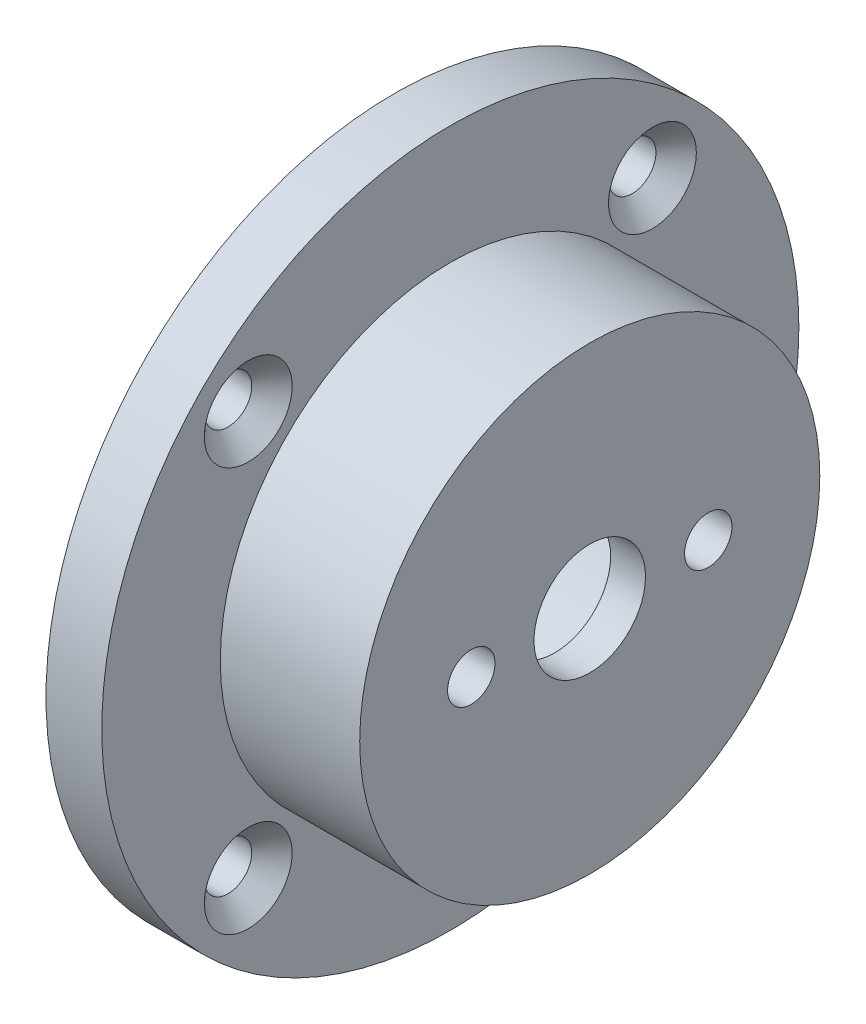
ISO-10303-21;
HEADER;
FILE_DESCRIPTION(('STEP AP214'),'2;1');
FILE_NAME('part.step','',(''),(''),'','','');
FILE_SCHEMA(('AUTOMOTIVE_DESIGN { 1 0 10303 214 1 1 1 1 }'));
ENDSEC;
DATA;
#1=APPLICATION_CONTEXT('core data for automotive mechanical design processes');
#2=APPLICATION_PROTOCOL_DEFINITION('international standard','automotive_design',2000,#1);
#3=PRODUCT_CONTEXT('',#1,'mechanical');
#4=PRODUCT('Part','Part','',(#3));
#5=PRODUCT_RELATED_PRODUCT_CATEGORY('part','',(#4));
#6=PRODUCT_DEFINITION_FORMATION('','',#4);
#7=PRODUCT_DEFINITION_CONTEXT('part definition',#1,'design');
#8=PRODUCT_DEFINITION('design','',#6,#7);
#9=PRODUCT_DEFINITION_SHAPE('','',#8);
#10=(LENGTH_UNIT() NAMED_UNIT(*) SI_UNIT(.MILLI.,.METRE.));
#11=(NAMED_UNIT(*) PLANE_ANGLE_UNIT() SI_UNIT($,.RADIAN.));
#12=(NAMED_UNIT(*) SI_UNIT($,.STERADIAN.) SOLID_ANGLE_UNIT());
#13=UNCERTAINTY_MEASURE_WITH_UNIT(LENGTH_MEASURE(1.E-05),#10,'distance_accuracy_value','');
#14=(GEOMETRIC_REPRESENTATION_CONTEXT(3) GLOBAL_UNCERTAINTY_ASSIGNED_CONTEXT((#13)) GLOBAL_UNIT_ASSIGNED_CONTEXT((#10,
#11,#12)) REPRESENTATION_CONTEXT('',''));
#15=CARTESIAN_POINT('',(0.,0.,0.));
#16=DIRECTION('',(0.,0.,1.));
#17=DIRECTION('',(1.,0.,0.));
#18=AXIS2_PLACEMENT_3D('',#15,#16,#17);
#19=CARTESIAN_POINT('',(4.,0.,0.));
#20=DIRECTION('',(1.,0.,0.));
#21=DIRECTION('',(0.,0.,-1.));
#22=AXIS2_PLACEMENT_3D('',#19,#20,#21);
#23=PLANE('',#22);
#24=CARTESIAN_POINT('',(4.,14.4956890143241,14.4956890143244));
#25=DIRECTION('',(1.,0.,0.));
#26=DIRECTION('',(0.,0.,-1.));
#27=AXIS2_PLACEMENT_3D('',#24,#25,#26);
#28=CIRCLE('',#27,3.15);
#29=CARTESIAN_POINT('',(4.,14.4956890143241,11.3456890143244));
#30=VERTEX_POINT('',#29);
#31=EDGE_CURVE('E147',#30,#30,#28,.T.);
#32=ORIENTED_EDGE('',*,*,#31,.F.);
#33=EDGE_LOOP('',(#32));
#34=FACE_BOUND('',#33,.T.);
#35=CARTESIAN_POINT('',(4.,14.4956890143242,-14.4956890143242));
#36=DIRECTION('',(1.,0.,0.));
#37=DIRECTION('',(0.,0.,-1.));
#38=AXIS2_PLACEMENT_3D('',#35,#36,#37);
#39=CIRCLE('',#38,3.15);
#40=CARTESIAN_POINT('',(4.,14.4956890143242,-17.6456890143242));
#41=VERTEX_POINT('',#40);
#42=EDGE_CURVE('E140',#41,#41,#39,.T.);
#43=ORIENTED_EDGE('',*,*,#42,.F.);
#44=EDGE_LOOP('',(#43));
#45=FACE_BOUND('',#44,.T.);
#46=CARTESIAN_POINT('',(4.,-14.4956890143242,-14.4956890143243));
#47=DIRECTION('',(1.,0.,0.));
#48=DIRECTION('',(0.,0.,-1.));
#49=AXIS2_PLACEMENT_3D('',#46,#47,#48);
#50=CIRCLE('',#49,3.15);
#51=CARTESIAN_POINT('',(4.,-14.4956890143242,-17.6456890143243));
#52=VERTEX_POINT('',#51);
#53=EDGE_CURVE('E133',#52,#52,#50,.T.);
#54=ORIENTED_EDGE('',*,*,#53,.F.);
#55=EDGE_LOOP('',(#54));
#56=FACE_BOUND('',#55,.T.);
#57=CARTESIAN_POINT('',(4.,-14.4956890143242,14.4956890143242));
#58=DIRECTION('',(1.,0.,0.));
#59=DIRECTION('',(0.,0.,-1.));
#60=AXIS2_PLACEMENT_3D('',#57,#58,#59);
#61=CIRCLE('',#60,3.15);
#62=CARTESIAN_POINT('',(4.,-14.4956890143242,11.3456890143242));
#63=VERTEX_POINT('',#62);
#64=EDGE_CURVE('E124',#63,#63,#61,.T.);
#65=ORIENTED_EDGE('',*,*,#64,.F.);
#66=EDGE_LOOP('',(#65));
#67=FACE_BOUND('',#66,.T.);
#68=CARTESIAN_POINT('',(4.,0.,0.));
#69=DIRECTION('',(1.,0.,0.));
#70=DIRECTION('',(0.,0.,-1.));
#71=AXIS2_PLACEMENT_3D('',#68,#69,#70);
#72=CIRCLE('',#71,25.);
#73=CARTESIAN_POINT('',(4.,0.,-25.));
#74=VERTEX_POINT('',#73);
#75=EDGE_CURVE('E11',#74,#74,#72,.T.);
#76=ORIENTED_EDGE('',*,*,#75,.T.);
#77=EDGE_LOOP('',(#76));
#78=FACE_BOUND('',#77,.T.);
#79=CARTESIAN_POINT('',(4.,0.,0.));
#80=DIRECTION('',(1.,0.,0.));
#81=DIRECTION('',(0.,0.,-1.));
#82=AXIS2_PLACEMENT_3D('',#79,#80,#81);
#83=CIRCLE('',#82,16.5);
#84=CARTESIAN_POINT('',(4.,0.,-16.5));
#85=VERTEX_POINT('',#84);
#86=EDGE_CURVE('E50',#85,#85,#83,.T.);
#87=ORIENTED_EDGE('',*,*,#86,.F.);
#88=EDGE_LOOP('',(#87));
#89=FACE_BOUND('',#88,.T.);
#90=ADVANCED_FACE('F34',(#34,#45,#56,#67,#78,#89),#23,.T.);
#91=CARTESIAN_POINT('',(4.,0.,0.));
#92=DIRECTION('',(-1.,0.,0.));
#93=DIRECTION('',(0.,0.,1.));
#94=AXIS2_PLACEMENT_3D('',#91,#92,#93);
#95=CYLINDRICAL_SURFACE('',#94,25.);
#96=ORIENTED_EDGE('',*,*,#75,.F.);
#97=EDGE_LOOP('',(#96));
#98=FACE_BOUND('',#97,.T.);
#99=CARTESIAN_POINT('',(0.,0.,0.));
#100=DIRECTION('',(1.,0.,0.));
#101=DIRECTION('',(0.,0.,-1.));
#102=AXIS2_PLACEMENT_3D('',#99,#100,#101);
#103=CIRCLE('',#102,25.);
#104=CARTESIAN_POINT('',(0.,0.,-25.));
#105=VERTEX_POINT('',#104);
#106=EDGE_CURVE('E42',#105,#105,#103,.T.);
#107=ORIENTED_EDGE('',*,*,#106,.T.);
#108=EDGE_LOOP('',(#107));
#109=FACE_BOUND('',#108,.T.);
#110=ADVANCED_FACE('F36',(#98,#109),#95,.T.);
#111=CARTESIAN_POINT('',(0.,0.,0.));
#112=DIRECTION('',(1.,0.,0.));
#113=DIRECTION('',(0.,0.,-1.));
#114=AXIS2_PLACEMENT_3D('',#111,#112,#113);
#115=PLANE('',#114);
#116=CARTESIAN_POINT('',(0.,0.,0.));
#117=DIRECTION('',(-1.,0.,0.));
#118=DIRECTION('',(0.,0.,1.));
#119=AXIS2_PLACEMENT_3D('',#116,#117,#118);
#120=CIRCLE('',#119,13.125);
#121=CARTESIAN_POINT('',(0.,0.,13.125));
#122=VERTEX_POINT('',#121);
#123=EDGE_CURVE('E101',#122,#122,#120,.T.);
#124=ORIENTED_EDGE('',*,*,#123,.F.);
#125=EDGE_LOOP('',(#124));
#126=FACE_BOUND('',#125,.T.);
#127=CARTESIAN_POINT('',(0.,14.4956890143241,14.4956890143244));
#128=DIRECTION('',(1.,0.,0.));
#129=DIRECTION('',(0.,0.,-1.));
#130=AXIS2_PLACEMENT_3D('',#127,#128,#129);
#131=CIRCLE('',#130,1.7);
#132=CARTESIAN_POINT('',(0.,14.4956890143241,12.7956890143244));
#133=VERTEX_POINT('',#132);
#134=EDGE_CURVE('E105',#133,#133,#131,.T.);
#135=ORIENTED_EDGE('',*,*,#134,.T.);
#136=EDGE_LOOP('',(#135));
#137=FACE_BOUND('',#136,.T.);
#138=CARTESIAN_POINT('',(0.,14.4956890143242,-14.4956890143242));
#139=DIRECTION('',(1.,0.,0.));
#140=DIRECTION('',(0.,0.,-1.));
#141=AXIS2_PLACEMENT_3D('',#138,#139,#140);
#142=CIRCLE('',#141,1.7);
#143=CARTESIAN_POINT('',(0.,14.4956890143242,-16.1956890143242));
#144=VERTEX_POINT('',#143);
#145=EDGE_CURVE('E109',#144,#144,#142,.T.);
#146=ORIENTED_EDGE('',*,*,#145,.T.);
#147=EDGE_LOOP('',(#146));
#148=FACE_BOUND('',#147,.T.);
#149=CARTESIAN_POINT('',(0.,-14.4956890143242,-14.4956890143243));
#150=DIRECTION('',(1.,0.,0.));
#151=DIRECTION('',(0.,0.,-1.));
#152=AXIS2_PLACEMENT_3D('',#149,#150,#151);
#153=CIRCLE('',#152,1.7);
#154=CARTESIAN_POINT('',(0.,-14.4956890143242,-16.1956890143243));
#155=VERTEX_POINT('',#154);
#156=EDGE_CURVE('E113',#155,#155,#153,.T.);
#157=ORIENTED_EDGE('',*,*,#156,.T.);
#158=EDGE_LOOP('',(#157));
#159=FACE_BOUND('',#158,.T.);
#160=CARTESIAN_POINT('',(0.,-14.4956890143242,14.4956890143242));
#161=DIRECTION('',(1.,0.,0.));
#162=DIRECTION('',(0.,0.,-1.));
#163=AXIS2_PLACEMENT_3D('',#160,#161,#162);
#164=CIRCLE('',#163,1.7);
#165=CARTESIAN_POINT('',(0.,-14.4956890143242,12.7956890143242));
#166=VERTEX_POINT('',#165);
#167=EDGE_CURVE('E117',#166,#166,#164,.T.);
#168=ORIENTED_EDGE('',*,*,#167,.T.);
#169=EDGE_LOOP('',(#168));
#170=FACE_BOUND('',#169,.T.);
#171=ORIENTED_EDGE('',*,*,#106,.F.);
#172=EDGE_LOOP('',(#171));
#173=FACE_BOUND('',#172,.T.);
#174=ADVANCED_FACE('F85',(#126,#137,#148,#159,#170,#173),#115,.F.);
#175=CARTESIAN_POINT('',(14.,0.,0.));
#176=DIRECTION('',(-1.,0.,0.));
#177=DIRECTION('',(0.,0.,1.));
#178=AXIS2_PLACEMENT_3D('',#175,#176,#177);
#179=CYLINDRICAL_SURFACE('',#178,16.5);
#180=CARTESIAN_POINT('',(14.,0.,0.));
#181=DIRECTION('',(1.,0.,0.));
#182=DIRECTION('',(0.,0.,-1.));
#183=AXIS2_PLACEMENT_3D('',#180,#181,#182);
#184=CIRCLE('',#183,16.5);
#185=CARTESIAN_POINT('',(14.,0.,-16.5));
#186=VERTEX_POINT('',#185);
#187=EDGE_CURVE('E47',#186,#186,#184,.T.);
#188=ORIENTED_EDGE('',*,*,#187,.F.);
#189=EDGE_LOOP('',(#188));
#190=FACE_BOUND('',#189,.T.);
#191=ORIENTED_EDGE('',*,*,#86,.T.);
#192=EDGE_LOOP('',(#191));
#193=FACE_BOUND('',#192,.T.);
#194=ADVANCED_FACE('F77',(#190,#193),#179,.T.);
#195=CARTESIAN_POINT('',(14.,0.,0.));
#196=DIRECTION('',(1.,0.,0.));
#197=DIRECTION('',(0.,0.,-1.));
#198=AXIS2_PLACEMENT_3D('',#195,#196,#197);
#199=PLANE('',#198);
#200=CARTESIAN_POINT('',(14.,0.,-8.5));
#201=DIRECTION('',(1.,0.,0.));
#202=DIRECTION('',(0.,0.,-1.));
#203=AXIS2_PLACEMENT_3D('',#200,#201,#202);
#204=CIRCLE('',#203,1.69999999999999);
#205=CARTESIAN_POINT('',(14.,0.,-10.2));
#206=VERTEX_POINT('',#205);
#207=EDGE_CURVE('E68',#206,#206,#204,.T.);
#208=ORIENTED_EDGE('',*,*,#207,.F.);
#209=EDGE_LOOP('',(#208));
#210=FACE_BOUND('',#209,.T.);
#211=CARTESIAN_POINT('',(14.,0.,8.5));
#212=DIRECTION('',(1.,0.,0.));
#213=DIRECTION('',(0.,0.,-1.));
#214=AXIS2_PLACEMENT_3D('',#211,#212,#213);
#215=CIRCLE('',#214,1.69999999999999);
#216=CARTESIAN_POINT('',(14.,0.,6.80000000000001));
#217=VERTEX_POINT('',#216);
#218=EDGE_CURVE('E58',#217,#217,#215,.T.);
#219=ORIENTED_EDGE('',*,*,#218,.F.);
#220=EDGE_LOOP('',(#219));
#221=FACE_BOUND('',#220,.T.);
#222=CARTESIAN_POINT('',(14.,0.,0.));
#223=DIRECTION('',(1.,0.,0.));
#224=DIRECTION('',(0.,0.,-1.));
#225=AXIS2_PLACEMENT_3D('',#222,#223,#224);
#226=CIRCLE('',#225,4.);
#227=CARTESIAN_POINT('',(14.,0.,-4.));
#228=VERTEX_POINT('',#227);
#229=EDGE_CURVE('E55',#228,#228,#226,.T.);
#230=ORIENTED_EDGE('',*,*,#229,.F.);
#231=EDGE_LOOP('',(#230));
#232=FACE_BOUND('',#231,.T.);
#233=ORIENTED_EDGE('',*,*,#187,.T.);
#234=EDGE_LOOP('',(#233));
#235=FACE_BOUND('',#234,.T.);
#236=ADVANCED_FACE('F96',(#210,#221,#232,#235),#199,.T.);
#237=CARTESIAN_POINT('',(11.5,0.,0.));
#238=DIRECTION('',(1.,0.,0.));
#239=DIRECTION('',(0.,0.,-1.));
#240=AXIS2_PLACEMENT_3D('',#237,#238,#239);
#241=PLANE('',#240);
#242=CARTESIAN_POINT('',(11.5,0.,-8.5));
#243=DIRECTION('',(1.,0.,0.));
#244=DIRECTION('',(0.,0.,-1.));
#245=AXIS2_PLACEMENT_3D('',#242,#243,#244);
#246=CIRCLE('',#245,1.69999999999999);
#247=CARTESIAN_POINT('',(11.5,0.,-10.2));
#248=VERTEX_POINT('',#247);
#249=EDGE_CURVE('E38',#248,#248,#246,.T.);
#250=ORIENTED_EDGE('',*,*,#249,.T.);
#251=EDGE_LOOP('',(#250));
#252=FACE_BOUND('',#251,.T.);
#253=CARTESIAN_POINT('',(11.5,0.,8.5));
#254=DIRECTION('',(1.,0.,0.));
#255=DIRECTION('',(0.,0.,-1.));
#256=AXIS2_PLACEMENT_3D('',#253,#254,#255);
#257=CIRCLE('',#256,1.69999999999999);
#258=CARTESIAN_POINT('',(11.5,0.,6.80000000000001));
#259=VERTEX_POINT('',#258);
#260=EDGE_CURVE('E56',#259,#259,#257,.T.);
#261=ORIENTED_EDGE('',*,*,#260,.T.);
#262=EDGE_LOOP('',(#261));
#263=FACE_BOUND('',#262,.T.);
#264=CARTESIAN_POINT('',(11.5,0.,0.));
#265=DIRECTION('',(1.,0.,0.));
#266=DIRECTION('',(0.,0.,-1.));
#267=AXIS2_PLACEMENT_3D('',#264,#265,#266);
#268=CIRCLE('',#267,4.);
#269=CARTESIAN_POINT('',(11.5,0.,-4.));
#270=VERTEX_POINT('',#269);
#271=EDGE_CURVE('E53',#270,#270,#268,.T.);
#272=ORIENTED_EDGE('',*,*,#271,.T.);
#273=EDGE_LOOP('',(#272));
#274=FACE_BOUND('',#273,.T.);
#275=CARTESIAN_POINT('',(11.5,0.,0.));
#276=DIRECTION('',(1.,0.,0.));
#277=DIRECTION('',(0.,0.,-1.));
#278=AXIS2_PLACEMENT_3D('',#275,#276,#277);
#279=CIRCLE('',#278,13.125);
#280=CARTESIAN_POINT('',(11.5,0.,-13.125));
#281=VERTEX_POINT('',#280);
#282=EDGE_CURVE('E150',#281,#281,#279,.F.);
#283=ORIENTED_EDGE('',*,*,#282,.T.);
#284=EDGE_LOOP('',(#283));
#285=FACE_BOUND('',#284,.T.);
#286=ADVANCED_FACE('F161',(#252,#263,#274,#285),#241,.F.);
#287=CARTESIAN_POINT('',(10.,0.,0.));
#288=DIRECTION('',(1.,0.,0.));
#289=DIRECTION('',(0.,0.,-1.));
#290=AXIS2_PLACEMENT_3D('',#287,#288,#289);
#291=CYLINDRICAL_SURFACE('',#290,4.);
#292=ORIENTED_EDGE('',*,*,#229,.T.);
#293=EDGE_LOOP('',(#292));
#294=FACE_BOUND('',#293,.T.);
#295=ORIENTED_EDGE('',*,*,#271,.F.);
#296=EDGE_LOOP('',(#295));
#297=FACE_BOUND('',#296,.T.);
#298=ADVANCED_FACE('F163',(#294,#297),#291,.F.);
#299=CARTESIAN_POINT('',(14.,0.,8.5));
#300=DIRECTION('',(1.,0.,0.));
#301=DIRECTION('',(0.,0.,-1.));
#302=AXIS2_PLACEMENT_3D('',#299,#300,#301);
#303=CYLINDRICAL_SURFACE('',#302,1.69999999999999);
#304=ORIENTED_EDGE('',*,*,#218,.T.);
#305=EDGE_LOOP('',(#304));
#306=FACE_BOUND('',#305,.T.);
#307=ORIENTED_EDGE('',*,*,#260,.F.);
#308=EDGE_LOOP('',(#307));
#309=FACE_BOUND('',#308,.T.);
#310=ADVANCED_FACE('F170',(#306,#309),#303,.F.);
#311=CARTESIAN_POINT('',(14.,0.,-8.5));
#312=DIRECTION('',(1.,0.,0.));
#313=DIRECTION('',(0.,0.,-1.));
#314=AXIS2_PLACEMENT_3D('',#311,#312,#313);
#315=CYLINDRICAL_SURFACE('',#314,1.69999999999999);
#316=ORIENTED_EDGE('',*,*,#207,.T.);
#317=EDGE_LOOP('',(#316));
#318=FACE_BOUND('',#317,.T.);
#319=ORIENTED_EDGE('',*,*,#249,.F.);
#320=EDGE_LOOP('',(#319));
#321=FACE_BOUND('',#320,.T.);
#322=ADVANCED_FACE('F177',(#318,#321),#315,.F.);
#323=CARTESIAN_POINT('',(4.,-14.4956890143242,14.4956890143242));
#324=DIRECTION('',(1.,0.,0.));
#325=DIRECTION('',(0.,0.,-1.));
#326=AXIS2_PLACEMENT_3D('',#323,#324,#325);
#327=CYLINDRICAL_SURFACE('',#326,1.7);
#328=ORIENTED_EDGE('',*,*,#167,.F.);
#329=EDGE_LOOP('',(#328));
#330=FACE_BOUND('',#329,.T.);
#331=CARTESIAN_POINT('',(2.55,-14.4956890143242,14.4956890143242));
#332=DIRECTION('',(1.,0.,0.));
#333=DIRECTION('',(0.,0.,-1.));
#334=AXIS2_PLACEMENT_3D('',#331,#332,#333);
#335=CIRCLE('',#334,1.7);
#336=CARTESIAN_POINT('',(2.55,-14.4956890143242,12.7956890143242));
#337=VERTEX_POINT('',#336);
#338=EDGE_CURVE('E121',#337,#337,#335,.T.);
#339=ORIENTED_EDGE('',*,*,#338,.T.);
#340=EDGE_LOOP('',(#339));
#341=FACE_BOUND('',#340,.T.);
#342=ADVANCED_FACE('F180',(#330,#341),#327,.F.);
#343=CARTESIAN_POINT('',(4.,-14.4956890143242,14.4956890143242));
#344=DIRECTION('',(1.,0.,0.));
#345=DIRECTION('',(0.,0.,-1.));
#346=AXIS2_PLACEMENT_3D('',#343,#344,#345);
#347=CONICAL_SURFACE('',#346,3.15,0.785398163397449);
#348=ORIENTED_EDGE('',*,*,#338,.F.);
#349=EDGE_LOOP('',(#348));
#350=FACE_BOUND('',#349,.T.);
#351=ORIENTED_EDGE('',*,*,#64,.T.);
#352=EDGE_LOOP('',(#351));
#353=FACE_BOUND('',#352,.T.);
#354=ADVANCED_FACE('F184',(#350,#353),#347,.F.);
#355=CARTESIAN_POINT('',(4.,-14.4956890143242,-14.4956890143243));
#356=DIRECTION('',(1.,0.,0.));
#357=DIRECTION('',(0.,0.,-1.));
#358=AXIS2_PLACEMENT_3D('',#355,#356,#357);
#359=CYLINDRICAL_SURFACE('',#358,1.7);
#360=ORIENTED_EDGE('',*,*,#156,.F.);
#361=EDGE_LOOP('',(#360));
#362=FACE_BOUND('',#361,.T.);
#363=CARTESIAN_POINT('',(2.55,-14.4956890143242,-14.4956890143243));
#364=DIRECTION('',(1.,0.,0.));
#365=DIRECTION('',(0.,0.,-1.));
#366=AXIS2_PLACEMENT_3D('',#363,#364,#365);
#367=CIRCLE('',#366,1.7);
#368=CARTESIAN_POINT('',(2.55,-14.4956890143242,-16.1956890143243));
#369=VERTEX_POINT('',#368);
#370=EDGE_CURVE('E130',#369,#369,#367,.T.);
#371=ORIENTED_EDGE('',*,*,#370,.T.);
#372=EDGE_LOOP('',(#371));
#373=FACE_BOUND('',#372,.T.);
#374=ADVANCED_FACE('F187',(#362,#373),#359,.F.);
#375=CARTESIAN_POINT('',(4.,-14.4956890143242,-14.4956890143243));
#376=DIRECTION('',(1.,0.,0.));
#377=DIRECTION('',(0.,0.,-1.));
#378=AXIS2_PLACEMENT_3D('',#375,#376,#377);
#379=CONICAL_SURFACE('',#378,3.15,0.785398163397448);
#380=ORIENTED_EDGE('',*,*,#370,.F.);
#381=EDGE_LOOP('',(#380));
#382=FACE_BOUND('',#381,.T.);
#383=ORIENTED_EDGE('',*,*,#53,.T.);
#384=EDGE_LOOP('',(#383));
#385=FACE_BOUND('',#384,.T.);
#386=ADVANCED_FACE('F191',(#382,#385),#379,.F.);
#387=CARTESIAN_POINT('',(4.,14.4956890143242,-14.4956890143242));
#388=DIRECTION('',(1.,0.,0.));
#389=DIRECTION('',(0.,0.,-1.));
#390=AXIS2_PLACEMENT_3D('',#387,#388,#389);
#391=CYLINDRICAL_SURFACE('',#390,1.7);
#392=ORIENTED_EDGE('',*,*,#145,.F.);
#393=EDGE_LOOP('',(#392));
#394=FACE_BOUND('',#393,.T.);
#395=CARTESIAN_POINT('',(2.55,14.4956890143242,-14.4956890143242));
#396=DIRECTION('',(1.,0.,0.));
#397=DIRECTION('',(0.,0.,-1.));
#398=AXIS2_PLACEMENT_3D('',#395,#396,#397);
#399=CIRCLE('',#398,1.7);
#400=CARTESIAN_POINT('',(2.55,14.4956890143242,-16.1956890143242));
#401=VERTEX_POINT('',#400);
#402=EDGE_CURVE('E137',#401,#401,#399,.T.);
#403=ORIENTED_EDGE('',*,*,#402,.T.);
#404=EDGE_LOOP('',(#403));
#405=FACE_BOUND('',#404,.T.);
#406=ADVANCED_FACE('F195',(#394,#405),#391,.F.);
#407=CARTESIAN_POINT('',(4.,14.4956890143242,-14.4956890143242));
#408=DIRECTION('',(1.,0.,0.));
#409=DIRECTION('',(0.,0.,-1.));
#410=AXIS2_PLACEMENT_3D('',#407,#408,#409);
#411=CONICAL_SURFACE('',#410,3.15,0.785398163397448);
#412=ORIENTED_EDGE('',*,*,#402,.F.);
#413=EDGE_LOOP('',(#412));
#414=FACE_BOUND('',#413,.T.);
#415=ORIENTED_EDGE('',*,*,#42,.T.);
#416=EDGE_LOOP('',(#415));
#417=FACE_BOUND('',#416,.T.);
#418=ADVANCED_FACE('F199',(#414,#417),#411,.F.);
#419=CARTESIAN_POINT('',(4.,14.4956890143241,14.4956890143244));
#420=DIRECTION('',(1.,0.,0.));
#421=DIRECTION('',(0.,0.,-1.));
#422=AXIS2_PLACEMENT_3D('',#419,#420,#421);
#423=CYLINDRICAL_SURFACE('',#422,1.7);
#424=ORIENTED_EDGE('',*,*,#134,.F.);
#425=EDGE_LOOP('',(#424));
#426=FACE_BOUND('',#425,.T.);
#427=CARTESIAN_POINT('',(2.55,14.4956890143241,14.4956890143244));
#428=DIRECTION('',(1.,0.,0.));
#429=DIRECTION('',(0.,0.,-1.));
#430=AXIS2_PLACEMENT_3D('',#427,#428,#429);
#431=CIRCLE('',#430,1.7);
#432=CARTESIAN_POINT('',(2.55,14.4956890143241,12.7956890143244));
#433=VERTEX_POINT('',#432);
#434=EDGE_CURVE('E144',#433,#433,#431,.T.);
#435=ORIENTED_EDGE('',*,*,#434,.T.);
#436=EDGE_LOOP('',(#435));
#437=FACE_BOUND('',#436,.T.);
#438=ADVANCED_FACE('F203',(#426,#437),#423,.F.);
#439=CARTESIAN_POINT('',(4.,14.4956890143241,14.4956890143244));
#440=DIRECTION('',(1.,0.,0.));
#441=DIRECTION('',(0.,0.,-1.));
#442=AXIS2_PLACEMENT_3D('',#439,#440,#441);
#443=CONICAL_SURFACE('',#442,3.15,0.785398163397448);
#444=ORIENTED_EDGE('',*,*,#434,.F.);
#445=EDGE_LOOP('',(#444));
#446=FACE_BOUND('',#445,.T.);
#447=ORIENTED_EDGE('',*,*,#31,.T.);
#448=EDGE_LOOP('',(#447));
#449=FACE_BOUND('',#448,.T.);
#450=ADVANCED_FACE('F157',(#446,#449),#443,.F.);
#451=CARTESIAN_POINT('',(48.6231060122937,0.,0.));
#452=DIRECTION('',(-1.,0.,0.));
#453=DIRECTION('',(0.,0.,1.));
#454=AXIS2_PLACEMENT_3D('',#451,#452,#453);
#455=CYLINDRICAL_SURFACE('',#454,13.125);
#456=ORIENTED_EDGE('',*,*,#123,.T.);
#457=EDGE_LOOP('',(#456));
#458=FACE_BOUND('',#457,.T.);
#459=ORIENTED_EDGE('',*,*,#282,.F.);
#460=EDGE_LOOP('',(#459));
#461=FACE_BOUND('',#460,.T.);
#462=ADVANCED_FACE('F154',(#458,#461),#455,.F.);
#463=CLOSED_SHELL('',(#90,#110,#174,#194,#236,#286,#298,#310,#322,#342,#354,#374,#386,#406,#418,
#438,#450,#462));
#464=MANIFOLD_SOLID_BREP('B2',#463);
#465=ADVANCED_BREP_SHAPE_REPRESENTATION('',(#18,#464),#14);
#466=SHAPE_DEFINITION_REPRESENTATION(#9,#465);
ENDSEC;
END-ISO-10303-21;
